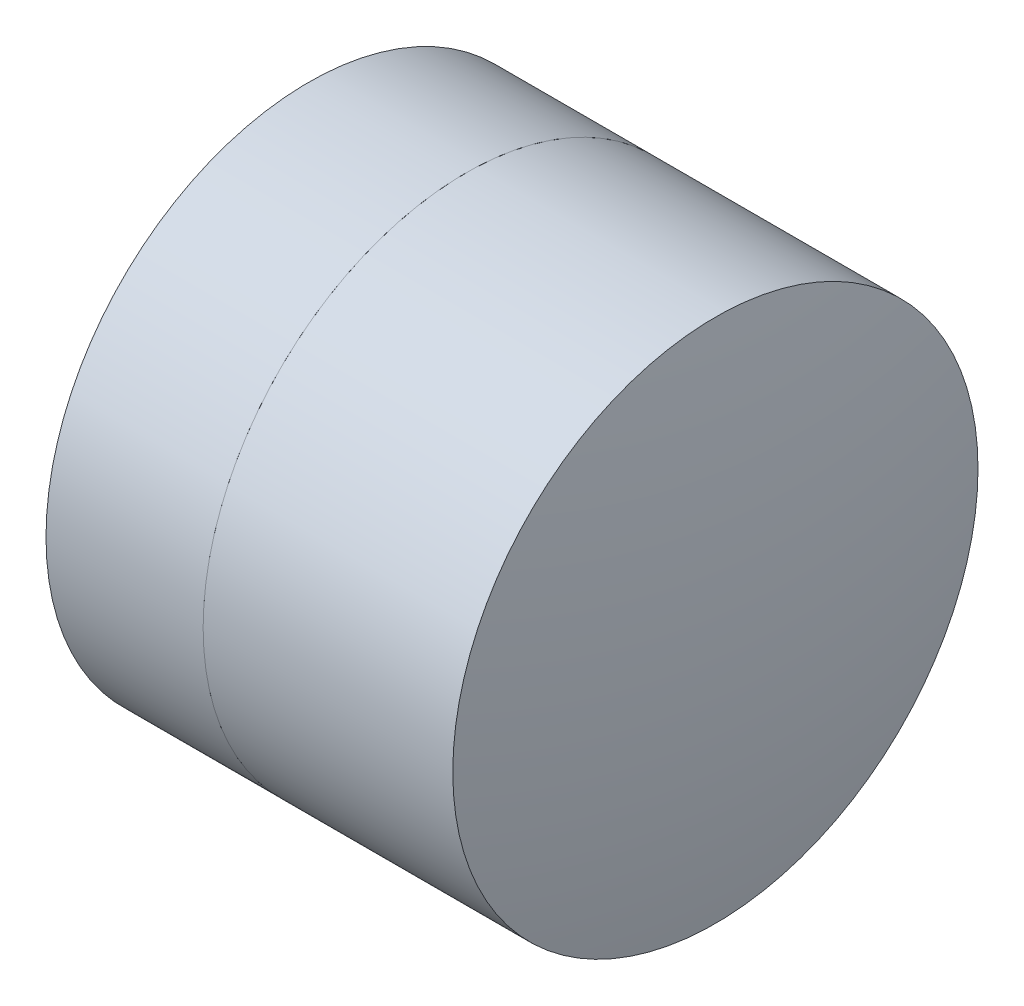
ISO-10303-21;
HEADER;
FILE_DESCRIPTION(('STEP AP214'),'2;1');
FILE_NAME('part.step','',(''),(''),'','','');
FILE_SCHEMA(('AUTOMOTIVE_DESIGN { 1 0 10303 214 1 1 1 1 }'));
ENDSEC;
DATA;
#1=APPLICATION_CONTEXT('core data for automotive mechanical design processes');
#2=APPLICATION_PROTOCOL_DEFINITION('international standard','automotive_design',2000,#1);
#3=PRODUCT_CONTEXT('',#1,'mechanical');
#4=PRODUCT('Part','Part','',(#3));
#5=PRODUCT_RELATED_PRODUCT_CATEGORY('part','',(#4));
#6=PRODUCT_DEFINITION_FORMATION('','',#4);
#7=PRODUCT_DEFINITION_CONTEXT('part definition',#1,'design');
#8=PRODUCT_DEFINITION('design','',#6,#7);
#9=PRODUCT_DEFINITION_SHAPE('','',#8);
#10=(LENGTH_UNIT() NAMED_UNIT(*) SI_UNIT(.MILLI.,.METRE.));
#11=(NAMED_UNIT(*) PLANE_ANGLE_UNIT() SI_UNIT($,.RADIAN.));
#12=(NAMED_UNIT(*) SI_UNIT($,.STERADIAN.) SOLID_ANGLE_UNIT());
#13=UNCERTAINTY_MEASURE_WITH_UNIT(LENGTH_MEASURE(1.E-05),#10,'distance_accuracy_value','');
#14=(GEOMETRIC_REPRESENTATION_CONTEXT(3) GLOBAL_UNCERTAINTY_ASSIGNED_CONTEXT((#13)) GLOBAL_UNIT_ASSIGNED_CONTEXT((#10,
#11,#12)) REPRESENTATION_CONTEXT('',''));
#15=CARTESIAN_POINT('',(0.,0.,0.));
#16=DIRECTION('',(0.,0.,1.));
#17=DIRECTION('',(1.,0.,0.));
#18=AXIS2_PLACEMENT_3D('',#15,#16,#17);
#19=CARTESIAN_POINT('',(0.177212435233161,0.,0.));
#20=DIRECTION('',(-1.,0.,0.));
#21=DIRECTION('',(0.,0.,-1.));
#22=AXIS2_PLACEMENT_3D('',#19,#20,#21);
#23=SPHERICAL_SURFACE('',#22,1.84800000000001);
#24=CARTESIAN_POINT('',(1.25661226847386,0.,0.));
#25=DIRECTION('',(-1.,0.,0.));
#26=DIRECTION('',(0.,0.,1.));
#27=AXIS2_PLACEMENT_3D('',#24,#25,#26);
#28=CIRCLE('',#27,1.5);
#29=CARTESIAN_POINT('',(1.25661226847386,0.,1.5));
#30=VERTEX_POINT('',#29);
#31=EDGE_CURVE('E51',#30,#30,#28,.T.);
#32=ORIENTED_EDGE('',*,*,#31,.T.);
#33=EDGE_LOOP('',(#32));
#34=FACE_BOUND('',#33,.T.);
#35=ADVANCED_FACE('F45',(#34),#23,.F.);
#36=CARTESIAN_POINT('',(-5.13478756476683,0.,0.));
#37=DIRECTION('',(-1.,0.,0.));
#38=DIRECTION('',(0.,0.,-1.));
#39=AXIS2_PLACEMENT_3D('',#36,#37,#38);
#40=SPHERICAL_SURFACE('',#39,7.96);
#41=CARTESIAN_POINT('',(2.68260330431475,0.,0.));
#42=DIRECTION('',(-1.,0.,0.));
#43=DIRECTION('',(0.,0.,1.));
#44=AXIS2_PLACEMENT_3D('',#41,#42,#43);
#45=CIRCLE('',#44,1.5);
#46=CARTESIAN_POINT('',(2.68260330431475,0.,1.5));
#47=VERTEX_POINT('',#46);
#48=EDGE_CURVE('E11',#47,#47,#45,.T.);
#49=ORIENTED_EDGE('',*,*,#48,.F.);
#50=EDGE_LOOP('',(#49));
#51=FACE_BOUND('',#50,.T.);
#52=ADVANCED_FACE('F60',(#51),#40,.T.);
#53=CARTESIAN_POINT('',(-0.551919992657797,0.,0.));
#54=DIRECTION('',(-1.,0.,0.));
#55=DIRECTION('',(0.,0.,1.));
#56=AXIS2_PLACEMENT_3D('',#53,#54,#55);
#57=CYLINDRICAL_SURFACE('',#56,1.5);
#58=ORIENTED_EDGE('',*,*,#48,.T.);
#59=EDGE_LOOP('',(#58));
#60=FACE_BOUND('',#59,.T.);
#61=ORIENTED_EDGE('',*,*,#31,.F.);
#62=EDGE_LOOP('',(#61));
#63=FACE_BOUND('',#62,.T.);
#64=ADVANCED_FACE('F58',(#60,#63),#57,.T.);
#65=CLOSED_SHELL('',(#35,#52,#64));
#66=MANIFOLD_SOLID_BREP('B2',#65);
#67=CARTESIAN_POINT('',(2.73521243523316,0.,0.));
#68=DIRECTION('',(-1.,0.,0.));
#69=DIRECTION('',(0.,0.,1.));
#70=AXIS2_PLACEMENT_3D('',#67,#68,#69);
#71=SPHERICAL_SURFACE('',#70,2.81);
#72=CARTESIAN_POINT('',(0.359060083215303,0.,0.));
#73=DIRECTION('',(-1.,0.,0.));
#74=DIRECTION('',(0.,0.,1.));
#75=AXIS2_PLACEMENT_3D('',#72,#73,#74);
#76=CIRCLE('',#75,1.5);
#77=CARTESIAN_POINT('',(0.359060083215303,0.,1.5));
#78=VERTEX_POINT('',#77);
#79=EDGE_CURVE('E44',#78,#78,#76,.T.);
#80=ORIENTED_EDGE('',*,*,#79,.T.);
#81=EDGE_LOOP('',(#80));
#82=FACE_BOUND('',#81,.T.);
#83=ADVANCED_FACE('F86',(#82),#71,.T.);
#84=CARTESIAN_POINT('',(-0.816062176165804,0.,0.));
#85=DIRECTION('',(-1.,0.,0.));
#86=DIRECTION('',(0.,0.,1.));
#87=AXIS2_PLACEMENT_3D('',#84,#85,#86);
#88=CYLINDRICAL_SURFACE('',#87,1.5);
#89=CARTESIAN_POINT('',(1.25661226847386,0.,0.));
#90=DIRECTION('',(-1.,0.,0.));
#91=DIRECTION('',(0.,0.,1.));
#92=AXIS2_PLACEMENT_3D('',#89,#90,#91);
#93=CIRCLE('',#92,1.5);
#94=CARTESIAN_POINT('',(1.25661226847386,0.,1.5));
#95=VERTEX_POINT('',#94);
#96=EDGE_CURVE('E92',#95,#95,#93,.T.);
#97=ORIENTED_EDGE('',*,*,#96,.T.);
#98=EDGE_LOOP('',(#97));
#99=FACE_BOUND('',#98,.T.);
#100=ORIENTED_EDGE('',*,*,#79,.F.);
#101=EDGE_LOOP('',(#100));
#102=FACE_BOUND('',#101,.T.);
#103=ADVANCED_FACE('F98',(#99,#102),#88,.T.);
#104=CARTESIAN_POINT('',(0.177212435233161,0.,0.));
#105=DIRECTION('',(-1.,0.,0.));
#106=DIRECTION('',(0.,0.,1.));
#107=AXIS2_PLACEMENT_3D('',#104,#105,#106);
#108=SPHERICAL_SURFACE('',#107,1.84800000000001);
#109=ORIENTED_EDGE('',*,*,#96,.F.);
#110=EDGE_LOOP('',(#109));
#111=FACE_BOUND('',#110,.T.);
#112=ADVANCED_FACE('F101',(#111),#108,.T.);
#113=CLOSED_SHELL('',(#83,#103,#112));
#114=MANIFOLD_SOLID_BREP('B6',#113);
#115=ADVANCED_BREP_SHAPE_REPRESENTATION('',(#18,#66,#114),#14);
#116=SHAPE_DEFINITION_REPRESENTATION(#9,#115);
ENDSEC;
END-ISO-10303-21;
